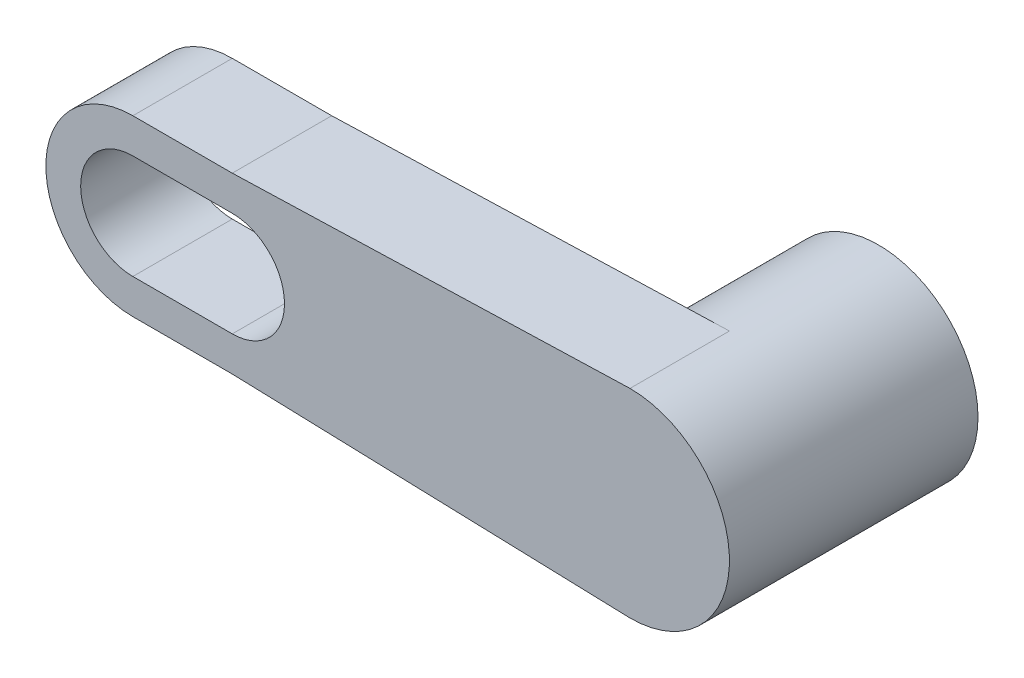
ISO-10303-21;
HEADER;
FILE_DESCRIPTION(('STEP AP214'),'2;1');
FILE_NAME('part.step','',(''),(''),'','','');
FILE_SCHEMA(('AUTOMOTIVE_DESIGN { 1 0 10303 214 1 1 1 1 }'));
ENDSEC;
DATA;
#1=APPLICATION_CONTEXT('core data for automotive mechanical design processes');
#2=APPLICATION_PROTOCOL_DEFINITION('international standard','automotive_design',2000,#1);
#3=PRODUCT_CONTEXT('',#1,'mechanical');
#4=PRODUCT('Part','Part','',(#3));
#5=PRODUCT_RELATED_PRODUCT_CATEGORY('part','',(#4));
#6=PRODUCT_DEFINITION_FORMATION('','',#4);
#7=PRODUCT_DEFINITION_CONTEXT('part definition',#1,'design');
#8=PRODUCT_DEFINITION('design','',#6,#7);
#9=PRODUCT_DEFINITION_SHAPE('','',#8);
#10=(LENGTH_UNIT() NAMED_UNIT(*) SI_UNIT(.MILLI.,.METRE.));
#11=(NAMED_UNIT(*) PLANE_ANGLE_UNIT() SI_UNIT($,.RADIAN.));
#12=(NAMED_UNIT(*) SI_UNIT($,.STERADIAN.) SOLID_ANGLE_UNIT());
#13=UNCERTAINTY_MEASURE_WITH_UNIT(LENGTH_MEASURE(1.E-05),#10,'distance_accuracy_value','');
#14=(GEOMETRIC_REPRESENTATION_CONTEXT(3) GLOBAL_UNCERTAINTY_ASSIGNED_CONTEXT((#13)) GLOBAL_UNIT_ASSIGNED_CONTEXT((#10,
#11,#12)) REPRESENTATION_CONTEXT('',''));
#15=CARTESIAN_POINT('',(0.,0.,0.));
#16=DIRECTION('',(0.,0.,1.));
#17=DIRECTION('',(1.,0.,0.));
#18=AXIS2_PLACEMENT_3D('',#15,#16,#17);
#19=CARTESIAN_POINT('',(-2.,0.,4.));
#20=DIRECTION('',(0.,0.,1.));
#21=DIRECTION('',(1.,0.,0.));
#22=AXIS2_PLACEMENT_3D('',#19,#20,#21);
#23=PLANE('',#22);
#24=DIRECTION('',(0.999512076087079,-0.0312347523777213,0.));
#25=VECTOR('',#24,1.);
#26=CARTESIAN_POINT('',(18.,-4.,4.));
#27=LINE('',#26,#25);
#28=CARTESIAN_POINT('',(2.,-3.5,4.));
#29=VERTEX_POINT('',#28);
#30=CARTESIAN_POINT('',(18.,-4.,4.));
#31=VERTEX_POINT('',#30);
#32=EDGE_CURVE('E237',#29,#31,#27,.T.);
#33=ORIENTED_EDGE('',*,*,#32,.T.);
#34=CARTESIAN_POINT('',(18.,0.,4.));
#35=DIRECTION('',(0.,0.,1.));
#36=DIRECTION('',(1.,0.,0.));
#37=AXIS2_PLACEMENT_3D('',#34,#35,#36);
#38=CIRCLE('',#37,4.);
#39=CARTESIAN_POINT('',(18.,4.,4.));
#40=VERTEX_POINT('',#39);
#41=EDGE_CURVE('E240',#31,#40,#38,.T.);
#42=ORIENTED_EDGE('',*,*,#41,.T.);
#43=DIRECTION('',(-0.999512076087079,-0.0312347523777213,0.));
#44=VECTOR('',#43,1.);
#45=CARTESIAN_POINT('',(2.,3.5,4.));
#46=LINE('',#45,#44);
#47=CARTESIAN_POINT('',(2.,3.5,4.));
#48=VERTEX_POINT('',#47);
#49=EDGE_CURVE('E243',#40,#48,#46,.T.);
#50=ORIENTED_EDGE('',*,*,#49,.T.);
#51=DIRECTION('',(-1.,0.,0.));
#52=VECTOR('',#51,1.);
#53=CARTESIAN_POINT('',(2.,3.5,4.));
#54=LINE('',#53,#52);
#55=CARTESIAN_POINT('',(-2.,3.5,4.));
#56=VERTEX_POINT('',#55);
#57=EDGE_CURVE('E245',#48,#56,#54,.T.);
#58=ORIENTED_EDGE('',*,*,#57,.T.);
#59=CARTESIAN_POINT('',(-2.,0.,4.));
#60=DIRECTION('',(0.,0.,1.));
#61=DIRECTION('',(1.,0.,0.));
#62=AXIS2_PLACEMENT_3D('',#59,#60,#61);
#63=CIRCLE('',#62,3.5);
#64=CARTESIAN_POINT('',(-2.,-3.5,4.));
#65=VERTEX_POINT('',#64);
#66=EDGE_CURVE('E247',#56,#65,#63,.T.);
#67=ORIENTED_EDGE('',*,*,#66,.T.);
#68=DIRECTION('',(1.,0.,0.));
#69=VECTOR('',#68,1.);
#70=CARTESIAN_POINT('',(2.,-3.5,4.));
#71=LINE('',#70,#69);
#72=EDGE_CURVE('E249',#65,#29,#71,.T.);
#73=ORIENTED_EDGE('',*,*,#72,.T.);
#74=EDGE_LOOP('',(#33,#42,#50,#58,#67,#73));
#75=FACE_BOUND('',#74,.T.);
#76=DIRECTION('',(1.,0.,0.));
#77=VECTOR('',#76,1.);
#78=CARTESIAN_POINT('',(-2.,-2.1,4.));
#79=LINE('',#78,#77);
#80=CARTESIAN_POINT('',(-2.,-2.1,4.));
#81=VERTEX_POINT('',#80);
#82=CARTESIAN_POINT('',(2.,-2.1,4.));
#83=VERTEX_POINT('',#82);
#84=EDGE_CURVE('E214',#81,#83,#79,.T.);
#85=ORIENTED_EDGE('',*,*,#84,.F.);
#86=CARTESIAN_POINT('',(-2.,0.,4.));
#87=DIRECTION('',(0.,0.,1.));
#88=DIRECTION('',(1.,0.,0.));
#89=AXIS2_PLACEMENT_3D('',#86,#87,#88);
#90=CIRCLE('',#89,2.1);
#91=CARTESIAN_POINT('',(-2.,2.1,4.));
#92=VERTEX_POINT('',#91);
#93=EDGE_CURVE('E212',#92,#81,#90,.T.);
#94=ORIENTED_EDGE('',*,*,#93,.F.);
#95=DIRECTION('',(-1.,0.,0.));
#96=VECTOR('',#95,1.);
#97=CARTESIAN_POINT('',(-2.,2.1,4.));
#98=LINE('',#97,#96);
#99=CARTESIAN_POINT('',(2.,2.1,4.));
#100=VERTEX_POINT('',#99);
#101=EDGE_CURVE('E219',#100,#92,#98,.T.);
#102=ORIENTED_EDGE('',*,*,#101,.F.);
#103=CARTESIAN_POINT('',(2.,0.,4.));
#104=DIRECTION('',(0.,0.,1.));
#105=DIRECTION('',(1.,0.,0.));
#106=AXIS2_PLACEMENT_3D('',#103,#104,#105);
#107=CIRCLE('',#106,2.1);
#108=EDGE_CURVE('E217',#83,#100,#107,.T.);
#109=ORIENTED_EDGE('',*,*,#108,.F.);
#110=EDGE_LOOP('',(#85,#94,#102,#109));
#111=FACE_BOUND('',#110,.T.);
#112=ADVANCED_FACE('F41',(#75,#111),#23,.T.);
#113=CARTESIAN_POINT('',(-2.,0.,0.));
#114=DIRECTION('',(0.,0.,1.));
#115=DIRECTION('',(1.,0.,0.));
#116=AXIS2_PLACEMENT_3D('',#113,#114,#115);
#117=PLANE('',#116);
#118=DIRECTION('',(-0.999512076087079,-0.0312347523777213,0.));
#119=VECTOR('',#118,1.);
#120=CARTESIAN_POINT('',(2.,3.5,0.));
#121=LINE('',#120,#119);
#122=CARTESIAN_POINT('',(17.750243902439,3.99219512195122,0.));
#123=VERTEX_POINT('',#122);
#124=CARTESIAN_POINT('',(2.,3.5,0.));
#125=VERTEX_POINT('',#124);
#126=EDGE_CURVE('E142',#123,#125,#121,.T.);
#127=ORIENTED_EDGE('',*,*,#126,.F.);
#128=CARTESIAN_POINT('',(18.,0.,0.));
#129=DIRECTION('',(0.,0.,1.));
#130=DIRECTION('',(1.,0.,0.));
#131=AXIS2_PLACEMENT_3D('',#128,#129,#130);
#132=CIRCLE('',#131,4.);
#133=CARTESIAN_POINT('',(17.7502439024389,-3.99219512195122,0.));
#134=VERTEX_POINT('',#133);
#135=EDGE_CURVE('E11',#123,#134,#132,.T.);
#136=ORIENTED_EDGE('',*,*,#135,.T.);
#137=DIRECTION('',(0.999512076087079,-0.0312347523777213,0.));
#138=VECTOR('',#137,1.);
#139=CARTESIAN_POINT('',(18.,-4.,0.));
#140=LINE('',#139,#138);
#141=CARTESIAN_POINT('',(2.,-3.5,0.));
#142=VERTEX_POINT('',#141);
#143=EDGE_CURVE('E150',#142,#134,#140,.T.);
#144=ORIENTED_EDGE('',*,*,#143,.F.);
#145=DIRECTION('',(1.,0.,0.));
#146=VECTOR('',#145,1.);
#147=CARTESIAN_POINT('',(2.,-3.5,0.));
#148=LINE('',#147,#146);
#149=CARTESIAN_POINT('',(-2.,-3.5,0.));
#150=VERTEX_POINT('',#149);
#151=EDGE_CURVE('E241',#150,#142,#148,.T.);
#152=ORIENTED_EDGE('',*,*,#151,.F.);
#153=CARTESIAN_POINT('',(-2.,0.,0.));
#154=DIRECTION('',(0.,0.,1.));
#155=DIRECTION('',(1.,0.,0.));
#156=AXIS2_PLACEMENT_3D('',#153,#154,#155);
#157=CIRCLE('',#156,3.5);
#158=CARTESIAN_POINT('',(-2.,3.5,0.));
#159=VERTEX_POINT('',#158);
#160=EDGE_CURVE('E253',#159,#150,#157,.T.);
#161=ORIENTED_EDGE('',*,*,#160,.F.);
#162=DIRECTION('',(-1.,0.,0.));
#163=VECTOR('',#162,1.);
#164=CARTESIAN_POINT('',(2.,3.5,0.));
#165=LINE('',#164,#163);
#166=EDGE_CURVE('E146',#125,#159,#165,.T.);
#167=ORIENTED_EDGE('',*,*,#166,.F.);
#168=EDGE_LOOP('',(#127,#136,#144,#152,#161,#167));
#169=FACE_BOUND('',#168,.T.);
#170=CARTESIAN_POINT('',(-2.,0.,0.));
#171=DIRECTION('',(0.,0.,1.));
#172=DIRECTION('',(1.,0.,0.));
#173=AXIS2_PLACEMENT_3D('',#170,#171,#172);
#174=CIRCLE('',#173,2.1);
#175=CARTESIAN_POINT('',(-2.,2.1,0.));
#176=VERTEX_POINT('',#175);
#177=CARTESIAN_POINT('',(-2.,-2.1,0.));
#178=VERTEX_POINT('',#177);
#179=EDGE_CURVE('E68',#176,#178,#174,.T.);
#180=ORIENTED_EDGE('',*,*,#179,.T.);
#181=DIRECTION('',(1.,0.,0.));
#182=VECTOR('',#181,1.);
#183=CARTESIAN_POINT('',(-2.,-2.1,0.));
#184=LINE('',#183,#182);
#185=CARTESIAN_POINT('',(2.,-2.1,0.));
#186=VERTEX_POINT('',#185);
#187=EDGE_CURVE('E223',#178,#186,#184,.T.);
#188=ORIENTED_EDGE('',*,*,#187,.T.);
#189=CARTESIAN_POINT('',(2.,0.,0.));
#190=DIRECTION('',(0.,0.,1.));
#191=DIRECTION('',(1.,0.,0.));
#192=AXIS2_PLACEMENT_3D('',#189,#190,#191);
#193=CIRCLE('',#192,2.1);
#194=CARTESIAN_POINT('',(2.,2.1,0.));
#195=VERTEX_POINT('',#194);
#196=EDGE_CURVE('E226',#186,#195,#193,.T.);
#197=ORIENTED_EDGE('',*,*,#196,.T.);
#198=DIRECTION('',(-1.,0.,0.));
#199=VECTOR('',#198,1.);
#200=CARTESIAN_POINT('',(-2.,2.1,0.));
#201=LINE('',#200,#199);
#202=EDGE_CURVE('E215',#195,#176,#201,.T.);
#203=ORIENTED_EDGE('',*,*,#202,.T.);
#204=EDGE_LOOP('',(#180,#188,#197,#203));
#205=FACE_BOUND('',#204,.T.);
#206=ADVANCED_FACE('F143',(#169,#205),#117,.F.);
#207=CARTESIAN_POINT('',(18.,-4.,4.));
#208=DIRECTION('',(0.0312347523777213,0.999512076087079,0.));
#209=DIRECTION('',(-0.999512076087079,0.0312347523777213,0.));
#210=AXIS2_PLACEMENT_3D('',#207,#208,#209);
#211=PLANE('',#210);
#212=ORIENTED_EDGE('',*,*,#143,.T.);
#213=CARTESIAN_POINT('',(17.7502439024389,-3.99219512195122,0.));
#214=DIRECTION('',(0.999512076087079,-0.0312347523777212,0.));
#215=VECTOR('',#214,1.);
#216=LINE('',#213,#215);
#217=CARTESIAN_POINT('',(18.0000000000001,-4.,0.));
#218=VERTEX_POINT('',#217);
#219=EDGE_CURVE('E137',#134,#218,#216,.T.);
#220=ORIENTED_EDGE('',*,*,#219,.T.);
#221=DIRECTION('',(0.,0.,-1.));
#222=VECTOR('',#221,1.);
#223=CARTESIAN_POINT('',(18.,-4.,4.));
#224=LINE('',#223,#222);
#225=EDGE_CURVE('E52',#31,#218,#224,.T.);
#226=ORIENTED_EDGE('',*,*,#225,.F.);
#227=ORIENTED_EDGE('',*,*,#32,.F.);
#228=DIRECTION('',(0.,0.,-1.));
#229=VECTOR('',#228,1.);
#230=CARTESIAN_POINT('',(2.,-3.5,4.));
#231=LINE('',#230,#229);
#232=EDGE_CURVE('E251',#29,#142,#231,.T.);
#233=ORIENTED_EDGE('',*,*,#232,.T.);
#234=EDGE_LOOP('',(#212,#220,#226,#227,#233));
#235=FACE_BOUND('',#234,.T.);
#236=ADVANCED_FACE('F43',(#235),#211,.F.);
#237=CARTESIAN_POINT('',(18.,0.,4.));
#238=DIRECTION('',(0.,0.,-1.));
#239=DIRECTION('',(-1.,0.,0.));
#240=AXIS2_PLACEMENT_3D('',#237,#238,#239);
#241=CYLINDRICAL_SURFACE('',#240,4.);
#242=ORIENTED_EDGE('',*,*,#225,.T.);
#243=ORIENTED_EDGE('',*,*,#219,.F.);
#244=ORIENTED_EDGE('',*,*,#135,.F.);
#245=CARTESIAN_POINT('',(18.,4.,0.));
#246=DIRECTION('',(-0.999512076087079,-0.0312347523777212,0.));
#247=VECTOR('',#246,1.);
#248=LINE('',#245,#247);
#249=CARTESIAN_POINT('',(18.,4.,0.));
#250=VERTEX_POINT('',#249);
#251=EDGE_CURVE('E134',#250,#123,#248,.T.);
#252=ORIENTED_EDGE('',*,*,#251,.F.);
#253=DIRECTION('',(0.,0.,-1.));
#254=VECTOR('',#253,1.);
#255=CARTESIAN_POINT('',(18.,4.,4.));
#256=LINE('',#255,#254);
#257=EDGE_CURVE('E155',#40,#250,#256,.T.);
#258=ORIENTED_EDGE('',*,*,#257,.F.);
#259=ORIENTED_EDGE('',*,*,#41,.F.);
#260=EDGE_LOOP('',(#242,#243,#244,#252,#258,#259));
#261=FACE_BOUND('',#260,.T.);
#262=CARTESIAN_POINT('',(18.,0.,-6.));
#263=DIRECTION('',(0.,0.,1.));
#264=DIRECTION('',(1.,0.,0.));
#265=AXIS2_PLACEMENT_3D('',#262,#263,#264);
#266=CIRCLE('',#265,4.);
#267=CARTESIAN_POINT('',(22.,0.,-6.));
#268=VERTEX_POINT('',#267);
#269=EDGE_CURVE('E210',#268,#268,#266,.T.);
#270=ORIENTED_EDGE('',*,*,#269,.T.);
#271=EDGE_LOOP('',(#270));
#272=FACE_BOUND('',#271,.T.);
#273=ADVANCED_FACE('F130',(#261,#272),#241,.T.);
#274=CARTESIAN_POINT('',(2.,3.5,4.));
#275=DIRECTION('',(0.0312347523777213,-0.999512076087079,0.));
#276=DIRECTION('',(0.999512076087079,0.0312347523777213,0.));
#277=AXIS2_PLACEMENT_3D('',#274,#275,#276);
#278=PLANE('',#277);
#279=ORIENTED_EDGE('',*,*,#251,.T.);
#280=ORIENTED_EDGE('',*,*,#126,.T.);
#281=DIRECTION('',(0.,0.,-1.));
#282=VECTOR('',#281,1.);
#283=CARTESIAN_POINT('',(2.,3.5,4.));
#284=LINE('',#283,#282);
#285=EDGE_CURVE('E158',#48,#125,#284,.T.);
#286=ORIENTED_EDGE('',*,*,#285,.F.);
#287=ORIENTED_EDGE('',*,*,#49,.F.);
#288=ORIENTED_EDGE('',*,*,#257,.T.);
#289=EDGE_LOOP('',(#279,#280,#286,#287,#288));
#290=FACE_BOUND('',#289,.T.);
#291=ADVANCED_FACE('F153',(#290),#278,.F.);
#292=CARTESIAN_POINT('',(2.,3.5,4.));
#293=DIRECTION('',(0.,-1.,0.));
#294=DIRECTION('',(1.,0.,0.));
#295=AXIS2_PLACEMENT_3D('',#292,#293,#294);
#296=PLANE('',#295);
#297=ORIENTED_EDGE('',*,*,#166,.T.);
#298=DIRECTION('',(0.,0.,-1.));
#299=VECTOR('',#298,1.);
#300=CARTESIAN_POINT('',(-2.,3.5,4.));
#301=LINE('',#300,#299);
#302=EDGE_CURVE('E260',#56,#159,#301,.T.);
#303=ORIENTED_EDGE('',*,*,#302,.F.);
#304=ORIENTED_EDGE('',*,*,#57,.F.);
#305=ORIENTED_EDGE('',*,*,#285,.T.);
#306=EDGE_LOOP('',(#297,#303,#304,#305));
#307=FACE_BOUND('',#306,.T.);
#308=ADVANCED_FACE('F173',(#307),#296,.F.);
#309=CARTESIAN_POINT('',(-2.,0.,4.));
#310=DIRECTION('',(0.,0.,-1.));
#311=DIRECTION('',(-1.,0.,0.));
#312=AXIS2_PLACEMENT_3D('',#309,#310,#311);
#313=CYLINDRICAL_SURFACE('',#312,3.5);
#314=ORIENTED_EDGE('',*,*,#160,.T.);
#315=DIRECTION('',(0.,0.,-1.));
#316=VECTOR('',#315,1.);
#317=CARTESIAN_POINT('',(-2.,-3.5,4.));
#318=LINE('',#317,#316);
#319=EDGE_CURVE('E258',#65,#150,#318,.T.);
#320=ORIENTED_EDGE('',*,*,#319,.F.);
#321=ORIENTED_EDGE('',*,*,#66,.F.);
#322=ORIENTED_EDGE('',*,*,#302,.T.);
#323=EDGE_LOOP('',(#314,#320,#321,#322));
#324=FACE_BOUND('',#323,.T.);
#325=ADVANCED_FACE('F276',(#324),#313,.T.);
#326=CARTESIAN_POINT('',(2.,-3.5,4.));
#327=DIRECTION('',(0.,1.,0.));
#328=DIRECTION('',(-1.,0.,0.));
#329=AXIS2_PLACEMENT_3D('',#326,#327,#328);
#330=PLANE('',#329);
#331=ORIENTED_EDGE('',*,*,#151,.T.);
#332=ORIENTED_EDGE('',*,*,#232,.F.);
#333=ORIENTED_EDGE('',*,*,#72,.F.);
#334=ORIENTED_EDGE('',*,*,#319,.T.);
#335=EDGE_LOOP('',(#331,#332,#333,#334));
#336=FACE_BOUND('',#335,.T.);
#337=ADVANCED_FACE('F274',(#336),#330,.F.);
#338=CARTESIAN_POINT('',(-2.,0.,4.));
#339=DIRECTION('',(0.,0.,-1.));
#340=DIRECTION('',(-1.,0.,0.));
#341=AXIS2_PLACEMENT_3D('',#338,#339,#340);
#342=CYLINDRICAL_SURFACE('',#341,2.1);
#343=ORIENTED_EDGE('',*,*,#179,.F.);
#344=DIRECTION('',(0.,0.,-1.));
#345=VECTOR('',#344,1.);
#346=CARTESIAN_POINT('',(-2.,2.1,4.));
#347=LINE('',#346,#345);
#348=EDGE_CURVE('E221',#92,#176,#347,.T.);
#349=ORIENTED_EDGE('',*,*,#348,.F.);
#350=ORIENTED_EDGE('',*,*,#93,.T.);
#351=DIRECTION('',(0.,0.,-1.));
#352=VECTOR('',#351,1.);
#353=CARTESIAN_POINT('',(-2.,-2.1,4.));
#354=LINE('',#353,#352);
#355=EDGE_CURVE('E235',#81,#178,#354,.T.);
#356=ORIENTED_EDGE('',*,*,#355,.T.);
#357=EDGE_LOOP('',(#343,#349,#350,#356));
#358=FACE_BOUND('',#357,.T.);
#359=ADVANCED_FACE('F282',(#358),#342,.F.);
#360=CARTESIAN_POINT('',(-2.,-2.1,4.));
#361=DIRECTION('',(0.,1.,0.));
#362=DIRECTION('',(-1.,0.,0.));
#363=AXIS2_PLACEMENT_3D('',#360,#361,#362);
#364=PLANE('',#363);
#365=ORIENTED_EDGE('',*,*,#187,.F.);
#366=ORIENTED_EDGE('',*,*,#355,.F.);
#367=ORIENTED_EDGE('',*,*,#84,.T.);
#368=DIRECTION('',(0.,0.,-1.));
#369=VECTOR('',#368,1.);
#370=CARTESIAN_POINT('',(2.,-2.1,4.));
#371=LINE('',#370,#369);
#372=EDGE_CURVE('E233',#83,#186,#371,.T.);
#373=ORIENTED_EDGE('',*,*,#372,.T.);
#374=EDGE_LOOP('',(#365,#366,#367,#373));
#375=FACE_BOUND('',#374,.T.);
#376=ADVANCED_FACE('F293',(#375),#364,.T.);
#377=CARTESIAN_POINT('',(2.,0.,4.));
#378=DIRECTION('',(0.,0.,-1.));
#379=DIRECTION('',(-1.,0.,0.));
#380=AXIS2_PLACEMENT_3D('',#377,#378,#379);
#381=CYLINDRICAL_SURFACE('',#380,2.1);
#382=ORIENTED_EDGE('',*,*,#196,.F.);
#383=ORIENTED_EDGE('',*,*,#372,.F.);
#384=ORIENTED_EDGE('',*,*,#108,.T.);
#385=DIRECTION('',(0.,0.,-1.));
#386=VECTOR('',#385,1.);
#387=CARTESIAN_POINT('',(2.,2.1,4.));
#388=LINE('',#387,#386);
#389=EDGE_CURVE('E60',#100,#195,#388,.T.);
#390=ORIENTED_EDGE('',*,*,#389,.T.);
#391=EDGE_LOOP('',(#382,#383,#384,#390));
#392=FACE_BOUND('',#391,.T.);
#393=ADVANCED_FACE('F296',(#392),#381,.F.);
#394=CARTESIAN_POINT('',(-2.,2.1,4.));
#395=DIRECTION('',(0.,-1.,0.));
#396=DIRECTION('',(1.,0.,0.));
#397=AXIS2_PLACEMENT_3D('',#394,#395,#396);
#398=PLANE('',#397);
#399=ORIENTED_EDGE('',*,*,#202,.F.);
#400=ORIENTED_EDGE('',*,*,#389,.F.);
#401=ORIENTED_EDGE('',*,*,#101,.T.);
#402=ORIENTED_EDGE('',*,*,#348,.T.);
#403=EDGE_LOOP('',(#399,#400,#401,#402));
#404=FACE_BOUND('',#403,.T.);
#405=ADVANCED_FACE('F300',(#404),#398,.T.);
#406=CARTESIAN_POINT('',(18.,0.,-6.));
#407=DIRECTION('',(0.,0.,1.));
#408=DIRECTION('',(1.,0.,0.));
#409=AXIS2_PLACEMENT_3D('',#406,#407,#408);
#410=PLANE('',#409);
#411=CARTESIAN_POINT('',(18.,0.,-6.));
#412=DIRECTION('',(0.,0.,1.));
#413=DIRECTION('',(1.,0.,0.));
#414=AXIS2_PLACEMENT_3D('',#411,#412,#413);
#415=CIRCLE('',#414,2.5);
#416=CARTESIAN_POINT('',(20.5,0.,-6.));
#417=VERTEX_POINT('',#416);
#418=EDGE_CURVE('E320',#417,#417,#415,.T.);
#419=ORIENTED_EDGE('',*,*,#418,.T.);
#420=EDGE_LOOP('',(#419));
#421=FACE_BOUND('',#420,.T.);
#422=ORIENTED_EDGE('',*,*,#269,.F.);
#423=EDGE_LOOP('',(#422));
#424=FACE_BOUND('',#423,.T.);
#425=ADVANCED_FACE('F304',(#421,#424),#410,.F.);
#426=CARTESIAN_POINT('',(18.,0.,-1.));
#427=DIRECTION('',(0.,0.,-1.));
#428=DIRECTION('',(-1.,0.,0.));
#429=AXIS2_PLACEMENT_3D('',#426,#427,#428);
#430=CYLINDRICAL_SURFACE('',#429,2.5);
#431=CARTESIAN_POINT('',(18.,0.,-1.));
#432=DIRECTION('',(0.,0.,1.));
#433=DIRECTION('',(1.,0.,0.));
#434=AXIS2_PLACEMENT_3D('',#431,#432,#433);
#435=CIRCLE('',#434,2.5);
#436=CARTESIAN_POINT('',(20.5,0.,-1.));
#437=VERTEX_POINT('',#436);
#438=EDGE_CURVE('E319',#437,#437,#435,.T.);
#439=ORIENTED_EDGE('',*,*,#438,.T.);
#440=EDGE_LOOP('',(#439));
#441=FACE_BOUND('',#440,.T.);
#442=ORIENTED_EDGE('',*,*,#418,.F.);
#443=EDGE_LOOP('',(#442));
#444=FACE_BOUND('',#443,.T.);
#445=ADVANCED_FACE('F307',(#441,#444),#430,.F.);
#446=CARTESIAN_POINT('',(18.,0.,-1.));
#447=DIRECTION('',(0.,0.,1.));
#448=DIRECTION('',(1.,0.,0.));
#449=AXIS2_PLACEMENT_3D('',#446,#447,#448);
#450=PLANE('',#449);
#451=ORIENTED_EDGE('',*,*,#438,.F.);
#452=EDGE_LOOP('',(#451));
#453=FACE_BOUND('',#452,.T.);
#454=ADVANCED_FACE('F311',(#453),#450,.F.);
#455=CLOSED_SHELL('',(#112,#206,#236,#273,#291,#308,#325,#337,#359,#376,#393,#405,#425,#445,#454));
#456=MANIFOLD_SOLID_BREP('B2',#455);
#457=ADVANCED_BREP_SHAPE_REPRESENTATION('',(#18,#456),#14);
#458=SHAPE_DEFINITION_REPRESENTATION(#9,#457);
ENDSEC;
END-ISO-10303-21;
